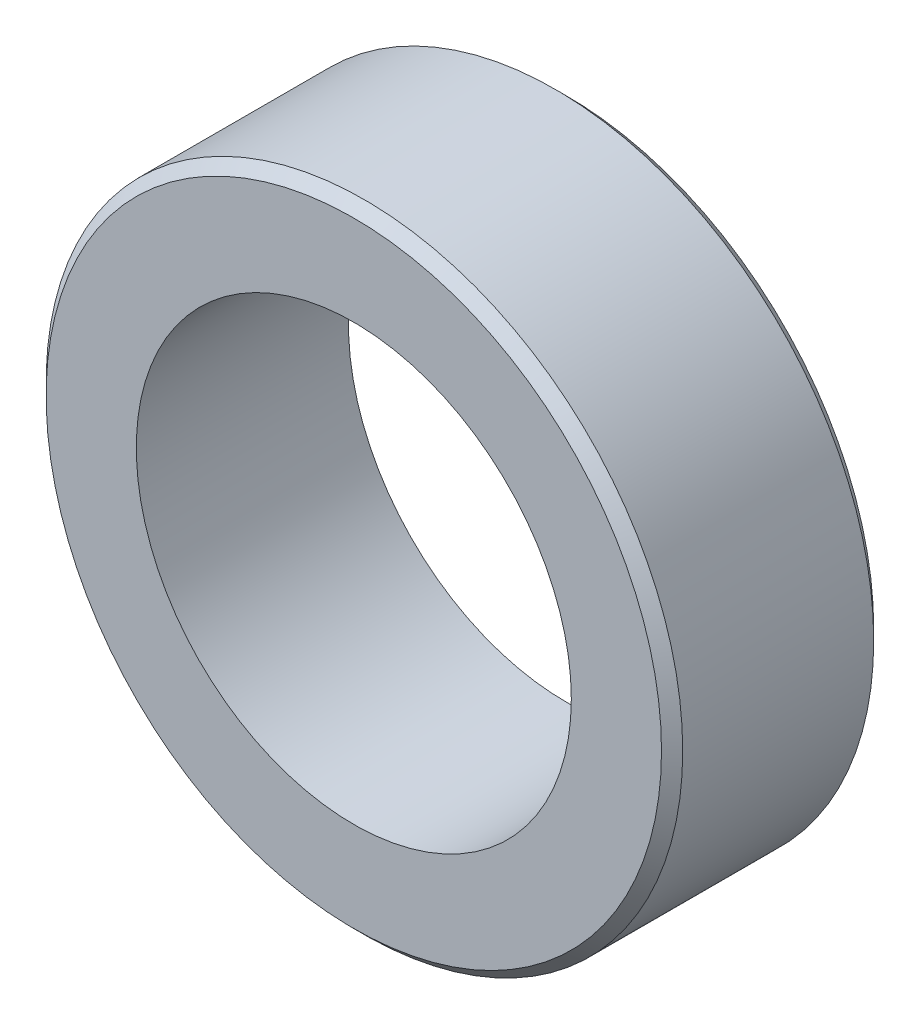
ISO-10303-21;
HEADER;
FILE_DESCRIPTION(('STEP AP214'),'2;1');
FILE_NAME('part.step','',(''),(''),'','','');
FILE_SCHEMA(('AUTOMOTIVE_DESIGN { 1 0 10303 214 1 1 1 1 }'));
ENDSEC;
DATA;
#1=APPLICATION_CONTEXT('core data for automotive mechanical design processes');
#2=APPLICATION_PROTOCOL_DEFINITION('international standard','automotive_design',2000,#1);
#3=PRODUCT_CONTEXT('',#1,'mechanical');
#4=PRODUCT('Part','Part','',(#3));
#5=PRODUCT_RELATED_PRODUCT_CATEGORY('part','',(#4));
#6=PRODUCT_DEFINITION_FORMATION('','',#4);
#7=PRODUCT_DEFINITION_CONTEXT('part definition',#1,'design');
#8=PRODUCT_DEFINITION('design','',#6,#7);
#9=PRODUCT_DEFINITION_SHAPE('','',#8);
#10=(LENGTH_UNIT() NAMED_UNIT(*) SI_UNIT(.MILLI.,.METRE.));
#11=(NAMED_UNIT(*) PLANE_ANGLE_UNIT() SI_UNIT($,.RADIAN.));
#12=(NAMED_UNIT(*) SI_UNIT($,.STERADIAN.) SOLID_ANGLE_UNIT());
#13=UNCERTAINTY_MEASURE_WITH_UNIT(LENGTH_MEASURE(1.E-05),#10,'distance_accuracy_value','');
#14=(GEOMETRIC_REPRESENTATION_CONTEXT(3) GLOBAL_UNCERTAINTY_ASSIGNED_CONTEXT((#13)) GLOBAL_UNIT_ASSIGNED_CONTEXT((#10,
#11,#12)) REPRESENTATION_CONTEXT('',''));
#15=CARTESIAN_POINT('',(0.,0.,0.));
#16=DIRECTION('',(0.,0.,1.));
#17=DIRECTION('',(1.,0.,0.));
#18=AXIS2_PLACEMENT_3D('',#15,#16,#17);
#19=CARTESIAN_POINT('',(0.,0.,2.));
#20=DIRECTION('',(0.,0.,1.));
#21=DIRECTION('',(1.,0.,0.));
#22=AXIS2_PLACEMENT_3D('',#19,#20,#21);
#23=PLANE('',#22);
#24=CARTESIAN_POINT('',(0.,0.,2.));
#25=DIRECTION('',(0.,0.,1.));
#26=DIRECTION('',(1.,0.,0.));
#27=AXIS2_PLACEMENT_3D('',#24,#25,#26);
#28=CIRCLE('',#27,2.9);
#29=CARTESIAN_POINT('',(2.9,0.,2.));
#30=VERTEX_POINT('',#29);
#31=EDGE_CURVE('E51',#30,#30,#28,.T.);
#32=ORIENTED_EDGE('',*,*,#31,.T.);
#33=EDGE_LOOP('',(#32));
#34=FACE_BOUND('',#33,.T.);
#35=CARTESIAN_POINT('',(0.,0.,2.));
#36=DIRECTION('',(0.,0.,1.));
#37=DIRECTION('',(1.,0.,0.));
#38=AXIS2_PLACEMENT_3D('',#35,#36,#37);
#39=CIRCLE('',#38,2.05);
#40=CARTESIAN_POINT('',(2.05,0.,2.));
#41=VERTEX_POINT('',#40);
#42=EDGE_CURVE('E56',#41,#41,#39,.T.);
#43=ORIENTED_EDGE('',*,*,#42,.F.);
#44=EDGE_LOOP('',(#43));
#45=FACE_BOUND('',#44,.T.);
#46=ADVANCED_FACE('F35',(#34,#45),#23,.T.);
#47=CARTESIAN_POINT('',(0.,0.,0.));
#48=DIRECTION('',(0.,0.,1.));
#49=DIRECTION('',(1.,0.,0.));
#50=AXIS2_PLACEMENT_3D('',#47,#48,#49);
#51=PLANE('',#50);
#52=CARTESIAN_POINT('',(0.,0.,0.));
#53=DIRECTION('',(0.,0.,1.));
#54=DIRECTION('',(1.,0.,0.));
#55=AXIS2_PLACEMENT_3D('',#52,#53,#54);
#56=CIRCLE('',#55,2.9);
#57=CARTESIAN_POINT('',(2.9,0.,0.));
#58=VERTEX_POINT('',#57);
#59=EDGE_CURVE('E10',#58,#58,#56,.F.);
#60=ORIENTED_EDGE('',*,*,#59,.T.);
#61=EDGE_LOOP('',(#60));
#62=FACE_BOUND('',#61,.T.);
#63=CARTESIAN_POINT('',(0.,0.,0.));
#64=DIRECTION('',(0.,0.,1.));
#65=DIRECTION('',(1.,0.,0.));
#66=AXIS2_PLACEMENT_3D('',#63,#64,#65);
#67=CIRCLE('',#66,2.05);
#68=CARTESIAN_POINT('',(2.05,0.,0.));
#69=VERTEX_POINT('',#68);
#70=EDGE_CURVE('E57',#69,#69,#67,.T.);
#71=ORIENTED_EDGE('',*,*,#70,.T.);
#72=EDGE_LOOP('',(#71));
#73=FACE_BOUND('',#72,.T.);
#74=ADVANCED_FACE('F67',(#62,#73),#51,.F.);
#75=CARTESIAN_POINT('',(0.,0.,2.));
#76=DIRECTION('',(0.,0.,-1.));
#77=DIRECTION('',(-1.,0.,0.));
#78=AXIS2_PLACEMENT_3D('',#75,#76,#77);
#79=CYLINDRICAL_SURFACE('',#78,3.);
#80=CARTESIAN_POINT('',(0.,0.,1.9));
#81=DIRECTION('',(0.,0.,1.));
#82=DIRECTION('',(1.,0.,0.));
#83=AXIS2_PLACEMENT_3D('',#80,#81,#82);
#84=CIRCLE('',#83,3.);
#85=CARTESIAN_POINT('',(3.,0.,1.9));
#86=VERTEX_POINT('',#85);
#87=EDGE_CURVE('E43',#86,#86,#84,.F.);
#88=ORIENTED_EDGE('',*,*,#87,.T.);
#89=EDGE_LOOP('',(#88));
#90=FACE_BOUND('',#89,.T.);
#91=CARTESIAN_POINT('',(0.,0.,0.1));
#92=DIRECTION('',(0.,0.,1.));
#93=DIRECTION('',(1.,0.,0.));
#94=AXIS2_PLACEMENT_3D('',#91,#92,#93);
#95=CIRCLE('',#94,3.);
#96=CARTESIAN_POINT('',(3.,0.,0.1));
#97=VERTEX_POINT('',#96);
#98=EDGE_CURVE('E47',#97,#97,#95,.T.);
#99=ORIENTED_EDGE('',*,*,#98,.T.);
#100=EDGE_LOOP('',(#99));
#101=FACE_BOUND('',#100,.T.);
#102=ADVANCED_FACE('F73',(#90,#101),#79,.T.);
#103=CARTESIAN_POINT('',(0.,0.,2.));
#104=DIRECTION('',(0.,0.,-1.));
#105=DIRECTION('',(-1.,0.,0.));
#106=AXIS2_PLACEMENT_3D('',#103,#104,#105);
#107=CYLINDRICAL_SURFACE('',#106,2.05);
#108=ORIENTED_EDGE('',*,*,#42,.T.);
#109=EDGE_LOOP('',(#108));
#110=FACE_BOUND('',#109,.T.);
#111=ORIENTED_EDGE('',*,*,#70,.F.);
#112=EDGE_LOOP('',(#111));
#113=FACE_BOUND('',#112,.T.);
#114=ADVANCED_FACE('F63',(#110,#113),#107,.F.);
#115=CARTESIAN_POINT('',(0.,0.,2.));
#116=DIRECTION('',(0.,0.,-1.));
#117=DIRECTION('',(-1.,0.,0.));
#118=AXIS2_PLACEMENT_3D('',#115,#116,#117);
#119=CONICAL_SURFACE('',#118,2.9,0.785398163397444);
#120=ORIENTED_EDGE('',*,*,#87,.F.);
#121=EDGE_LOOP('',(#120));
#122=FACE_BOUND('',#121,.T.);
#123=ORIENTED_EDGE('',*,*,#31,.F.);
#124=EDGE_LOOP('',(#123));
#125=FACE_BOUND('',#124,.T.);
#126=ADVANCED_FACE('F79',(#122,#125),#119,.T.);
#127=CARTESIAN_POINT('',(0.,0.,0.1));
#128=DIRECTION('',(0.,0.,1.));
#129=DIRECTION('',(1.,0.,0.));
#130=AXIS2_PLACEMENT_3D('',#127,#128,#129);
#131=CONICAL_SURFACE('',#130,3.,0.785398163397446);
#132=ORIENTED_EDGE('',*,*,#59,.F.);
#133=EDGE_LOOP('',(#132));
#134=FACE_BOUND('',#133,.T.);
#135=ORIENTED_EDGE('',*,*,#98,.F.);
#136=EDGE_LOOP('',(#135));
#137=FACE_BOUND('',#136,.T.);
#138=ADVANCED_FACE('F38',(#134,#137),#131,.T.);
#139=CLOSED_SHELL('',(#46,#74,#102,#114,#126,#138));
#140=MANIFOLD_SOLID_BREP('B2',#139);
#141=ADVANCED_BREP_SHAPE_REPRESENTATION('',(#18,#140),#14);
#142=SHAPE_DEFINITION_REPRESENTATION(#9,#141);
ENDSEC;
END-ISO-10303-21;
